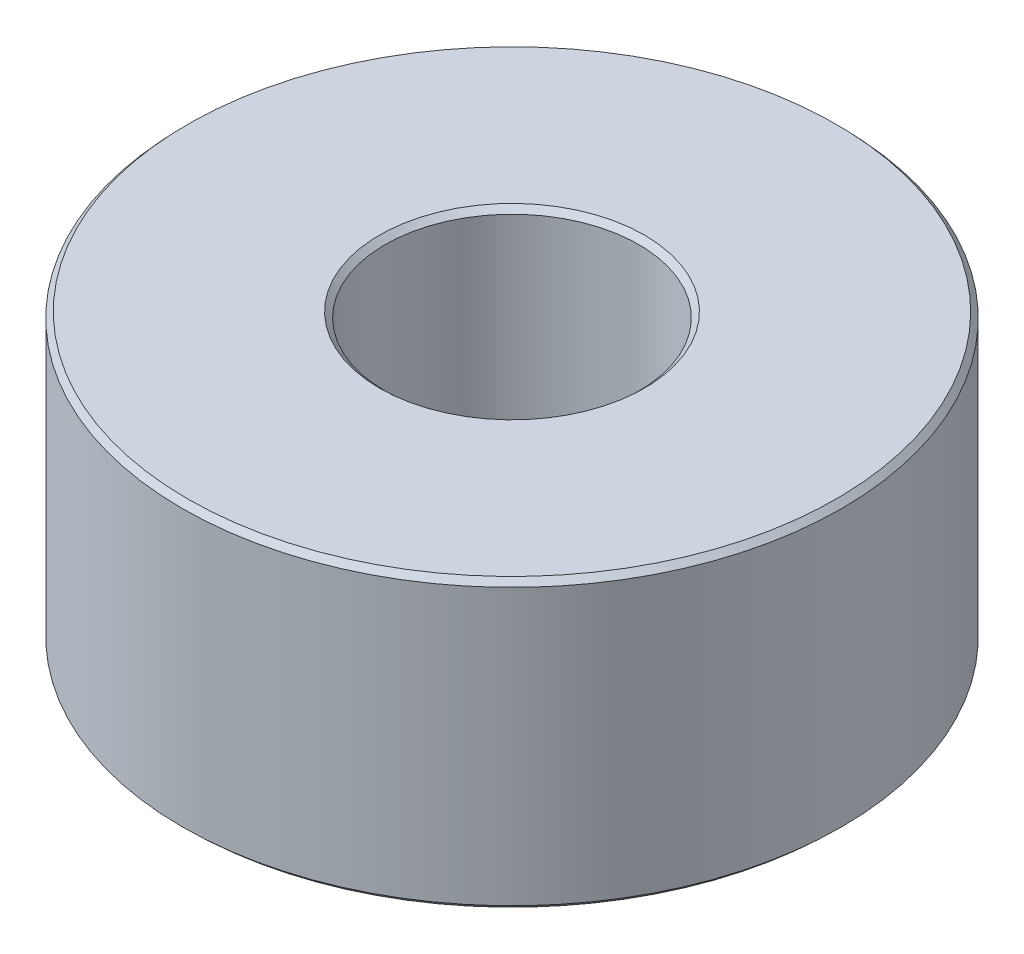
ISO-10303-21;
HEADER;
FILE_DESCRIPTION(('STEP AP214'),'2;1');
FILE_NAME('part.step','',(''),(''),'','','');
FILE_SCHEMA(('AUTOMOTIVE_DESIGN { 1 0 10303 214 1 1 1 1 }'));
ENDSEC;
DATA;
#1=APPLICATION_CONTEXT('core data for automotive mechanical design processes');
#2=APPLICATION_PROTOCOL_DEFINITION('international standard','automotive_design',2000,#1);
#3=PRODUCT_CONTEXT('',#1,'mechanical');
#4=PRODUCT('Part','Part','',(#3));
#5=PRODUCT_RELATED_PRODUCT_CATEGORY('part','',(#4));
#6=PRODUCT_DEFINITION_FORMATION('','',#4);
#7=PRODUCT_DEFINITION_CONTEXT('part definition',#1,'design');
#8=PRODUCT_DEFINITION('design','',#6,#7);
#9=PRODUCT_DEFINITION_SHAPE('','',#8);
#10=(LENGTH_UNIT() NAMED_UNIT(*) SI_UNIT(.MILLI.,.METRE.));
#11=(NAMED_UNIT(*) PLANE_ANGLE_UNIT() SI_UNIT($,.RADIAN.));
#12=(NAMED_UNIT(*) SI_UNIT($,.STERADIAN.) SOLID_ANGLE_UNIT());
#13=UNCERTAINTY_MEASURE_WITH_UNIT(LENGTH_MEASURE(1.E-05),#10,'distance_accuracy_value','');
#14=(GEOMETRIC_REPRESENTATION_CONTEXT(3) GLOBAL_UNCERTAINTY_ASSIGNED_CONTEXT((#13)) GLOBAL_UNIT_ASSIGNED_CONTEXT((#10,
#11,#12)) REPRESENTATION_CONTEXT('',''));
#15=CARTESIAN_POINT('',(0.,0.,0.));
#16=DIRECTION('',(0.,0.,1.));
#17=DIRECTION('',(1.,0.,0.));
#18=AXIS2_PLACEMENT_3D('',#15,#16,#17);
#19=CARTESIAN_POINT('',(0.,36.9616124464068,0.));
#20=DIRECTION('',(0.,-1.,0.));
#21=DIRECTION('',(0.,0.,-1.));
#22=AXIS2_PLACEMENT_3D('',#19,#20,#21);
#23=CYLINDRICAL_SURFACE('',#22,42.5);
#24=CARTESIAN_POINT('',(0.,0.688716306798586,0.));
#25=DIRECTION('',(0.,1.,0.));
#26=DIRECTION('',(0.,0.,1.));
#27=AXIS2_PLACEMENT_3D('',#24,#25,#26);
#28=CIRCLE('',#27,42.5);
#29=CARTESIAN_POINT('',(0.,0.688716306798585,42.5));
#30=VERTEX_POINT('',#29);
#31=EDGE_CURVE('E10',#30,#30,#28,.T.);
#32=ORIENTED_EDGE('',*,*,#31,.T.);
#33=EDGE_LOOP('',(#32));
#34=FACE_BOUND('',#33,.T.);
#35=CARTESIAN_POINT('',(0.,36.2285467041578,0.));
#36=DIRECTION('',(0.,1.,0.));
#37=DIRECTION('',(0.,0.,1.));
#38=AXIS2_PLACEMENT_3D('',#35,#36,#37);
#39=CIRCLE('',#38,42.5);
#40=CARTESIAN_POINT('',(0.,36.2285467041578,42.5));
#41=VERTEX_POINT('',#40);
#42=EDGE_CURVE('E50',#41,#41,#39,.F.);
#43=ORIENTED_EDGE('',*,*,#42,.T.);
#44=EDGE_LOOP('',(#43));
#45=FACE_BOUND('',#44,.T.);
#46=ADVANCED_FACE('F39',(#34,#45),#23,.T.);
#47=CARTESIAN_POINT('',(0.,36.9616124464068,0.));
#48=DIRECTION('',(0.,1.,0.));
#49=DIRECTION('',(0.,0.,1.));
#50=AXIS2_PLACEMENT_3D('',#47,#48,#49);
#51=PLANE('',#50);
#52=CARTESIAN_POINT('',(0.,36.9616124464068,0.));
#53=DIRECTION('',(0.,1.,0.));
#54=DIRECTION('',(0.,0.,1.));
#55=AXIS2_PLACEMENT_3D('',#52,#53,#54);
#56=CIRCLE('',#55,17.0864884740566);
#57=CARTESIAN_POINT('',(0.,36.9616124464068,17.0864884740566));
#58=VERTEX_POINT('',#57);
#59=EDGE_CURVE('E58',#58,#58,#56,.F.);
#60=ORIENTED_EDGE('',*,*,#59,.T.);
#61=EDGE_LOOP('',(#60));
#62=FACE_BOUND('',#61,.T.);
#63=CARTESIAN_POINT('',(0.,36.9616124464068,0.));
#64=DIRECTION('',(0.,1.,0.));
#65=DIRECTION('',(0.,0.,1.));
#66=AXIS2_PLACEMENT_3D('',#63,#64,#65);
#67=CIRCLE('',#66,41.8112836932014);
#68=CARTESIAN_POINT('',(0.,36.9616124464068,41.8112836932014));
#69=VERTEX_POINT('',#68);
#70=EDGE_CURVE('E61',#69,#69,#67,.T.);
#71=ORIENTED_EDGE('',*,*,#70,.T.);
#72=EDGE_LOOP('',(#71));
#73=FACE_BOUND('',#72,.T.);
#74=ADVANCED_FACE('F88',(#62,#73),#51,.T.);
#75=CARTESIAN_POINT('',(0.,0.,0.));
#76=DIRECTION('',(0.,1.,0.));
#77=DIRECTION('',(0.,0.,1.));
#78=AXIS2_PLACEMENT_3D('',#75,#76,#77);
#79=PLANE('',#78);
#80=CARTESIAN_POINT('',(0.,0.,0.));
#81=DIRECTION('',(0.,1.,0.));
#82=DIRECTION('',(0.,0.,1.));
#83=AXIS2_PLACEMENT_3D('',#80,#81,#82);
#84=CIRCLE('',#83,17.0421390386063);
#85=CARTESIAN_POINT('',(0.,0.,17.0421390386063));
#86=VERTEX_POINT('',#85);
#87=EDGE_CURVE('E51',#86,#86,#84,.T.);
#88=ORIENTED_EDGE('',*,*,#87,.T.);
#89=EDGE_LOOP('',(#88));
#90=FACE_BOUND('',#89,.T.);
#91=CARTESIAN_POINT('',(0.,0.,0.));
#92=DIRECTION('',(0.,1.,0.));
#93=DIRECTION('',(0.,0.,1.));
#94=AXIS2_PLACEMENT_3D('',#91,#92,#93);
#95=CIRCLE('',#94,41.7669342577511);
#96=CARTESIAN_POINT('',(0.,0.,41.7669342577511));
#97=VERTEX_POINT('',#96);
#98=EDGE_CURVE('E54',#97,#97,#95,.F.);
#99=ORIENTED_EDGE('',*,*,#98,.T.);
#100=EDGE_LOOP('',(#99));
#101=FACE_BOUND('',#100,.T.);
#102=ADVANCED_FACE('F83',(#90,#101),#79,.F.);
#103=CARTESIAN_POINT('',(0.,36.9616124464068,0.));
#104=DIRECTION('',(0.,-1.,0.));
#105=DIRECTION('',(0.,0.,-1.));
#106=AXIS2_PLACEMENT_3D('',#103,#104,#105);
#107=CYLINDRICAL_SURFACE('',#106,16.3534227318077);
#108=CARTESIAN_POINT('',(0.,36.2728961396082,0.));
#109=DIRECTION('',(0.,1.,0.));
#110=DIRECTION('',(0.,0.,1.));
#111=AXIS2_PLACEMENT_3D('',#108,#109,#110);
#112=CIRCLE('',#111,16.3534227318077);
#113=CARTESIAN_POINT('',(0.,36.2728961396082,16.3534227318077));
#114=VERTEX_POINT('',#113);
#115=EDGE_CURVE('E67',#114,#114,#112,.T.);
#116=ORIENTED_EDGE('',*,*,#115,.T.);
#117=EDGE_LOOP('',(#116));
#118=FACE_BOUND('',#117,.T.);
#119=CARTESIAN_POINT('',(0.,0.733065742248969,0.));
#120=DIRECTION('',(0.,1.,0.));
#121=DIRECTION('',(0.,0.,1.));
#122=AXIS2_PLACEMENT_3D('',#119,#120,#121);
#123=CIRCLE('',#122,16.3534227318077);
#124=CARTESIAN_POINT('',(0.,0.733065742248969,16.3534227318077));
#125=VERTEX_POINT('',#124);
#126=EDGE_CURVE('E69',#125,#125,#123,.F.);
#127=ORIENTED_EDGE('',*,*,#126,.T.);
#128=EDGE_LOOP('',(#127));
#129=FACE_BOUND('',#128,.T.);
#130=ADVANCED_FACE('F71',(#118,#129),#107,.F.);
#131=CARTESIAN_POINT('',(0.,36.2728961396082,0.));
#132=DIRECTION('',(0.,1.,0.));
#133=DIRECTION('',(0.,0.,1.));
#134=AXIS2_PLACEMENT_3D('',#131,#132,#133);
#135=CONICAL_SURFACE('',#134,16.3534227318077,0.816580903368573);
#136=CARTESIAN_POINT('',(0.,36.9616124464068,17.0864884740566));
#137=CARTESIAN_POINT('',(0.,36.954438318211,17.0788523725748));
#138=CARTESIAN_POINT('',(0.,36.9472641900152,17.0712162710931));
#139=CARTESIAN_POINT('',(0.,36.9329159336235,17.0559440681295));
#140=CARTESIAN_POINT('',(0.,36.9257418054277,17.0483079666478));
#141=CARTESIAN_POINT('',(0.,36.9113935490361,17.0330357636843));
#142=CARTESIAN_POINT('',(0.,36.9042194208403,17.0253996622025));
#143=CARTESIAN_POINT('',(0.,36.8898711644486,17.010127459239));
#144=CARTESIAN_POINT('',(0.,36.8826970362528,17.0024913577572));
#145=CARTESIAN_POINT('',(0.,36.8683487798612,16.9872191547937));
#146=CARTESIAN_POINT('',(0.,36.8611746516653,16.9795830533119));
#147=CARTESIAN_POINT('',(0.,36.8468263952737,16.9643108503484));
#148=CARTESIAN_POINT('',(0.,36.8396522670779,16.9566747488667));
#149=CARTESIAN_POINT('',(0.,36.8253040106862,16.9414025459031));
#150=CARTESIAN_POINT('',(0.,36.8181298824904,16.9337664444214));
#151=CARTESIAN_POINT('',(0.,36.8037816260988,16.9184942414579));
#152=CARTESIAN_POINT('',(0.,36.796607497903,16.9108581399761));
#153=CARTESIAN_POINT('',(0.,36.7822592415113,16.8955859370126));
#154=CARTESIAN_POINT('',(0.,36.7750851133155,16.8879498355308));
#155=CARTESIAN_POINT('',(0.,36.7607368569239,16.8726776325673));
#156=CARTESIAN_POINT('',(0.,36.7535627287281,16.8650415310855));
#157=CARTESIAN_POINT('',(0.,36.7392144723364,16.849769328122));
#158=CARTESIAN_POINT('',(0.,36.7320403441406,16.8421332266403));
#159=CARTESIAN_POINT('',(0.,36.717692087749,16.8268610236768));
#160=CARTESIAN_POINT('',(0.,36.7105179595532,16.819224922195));
#161=CARTESIAN_POINT('',(0.,36.6961697031615,16.8039527192315));
#162=CARTESIAN_POINT('',(0.,36.6889955749657,16.7963166177497));
#163=CARTESIAN_POINT('',(0.,36.6746473185741,16.7810444147862));
#164=CARTESIAN_POINT('',(0.,36.6674731903782,16.7734083133044));
#165=CARTESIAN_POINT('',(0.,36.6531249339866,16.7581361103409));
#166=CARTESIAN_POINT('',(0.,36.6459508057908,16.7505000088592));
#167=CARTESIAN_POINT('',(0.,36.6316025493991,16.7352278058956));
#168=CARTESIAN_POINT('',(0.,36.6244284212033,16.7275917044139));
#169=CARTESIAN_POINT('',(0.,36.6100801648117,16.7123195014504));
#170=CARTESIAN_POINT('',(0.,36.6029060366159,16.7046833999686));
#171=CARTESIAN_POINT('',(0.,36.5885577802242,16.6894111970051));
#172=CARTESIAN_POINT('',(0.,36.5813836520284,16.6817750955233));
#173=CARTESIAN_POINT('',(0.,36.5670353956368,16.6665028925598));
#174=CARTESIAN_POINT('',(0.,36.559861267441,16.658866791078));
#175=CARTESIAN_POINT('',(0.,36.5455130110493,16.6435945881145));
#176=CARTESIAN_POINT('',(0.,36.5383388828535,16.6359584866328));
#177=CARTESIAN_POINT('',(0.,36.5239906264619,16.6206862836692));
#178=CARTESIAN_POINT('',(0.,36.5168164982661,16.6130501821875));
#179=CARTESIAN_POINT('',(0.,36.5024682418744,16.597777979224));
#180=CARTESIAN_POINT('',(0.,36.4952941136786,16.5901418777422));
#181=CARTESIAN_POINT('',(0.,36.480945857287,16.5748696747787));
#182=CARTESIAN_POINT('',(0.,36.4737717290911,16.5672335732969));
#183=CARTESIAN_POINT('',(0.,36.4594234726995,16.5519613703334));
#184=CARTESIAN_POINT('',(0.,36.4522493445037,16.5443252688516));
#185=CARTESIAN_POINT('',(0.,36.4379010881121,16.5290530658881));
#186=CARTESIAN_POINT('',(0.,36.4307269599162,16.5214169644064));
#187=CARTESIAN_POINT('',(0.,36.4163787035246,16.5061447614429));
#188=CARTESIAN_POINT('',(0.,36.4092045753288,16.4985086599611));
#189=CARTESIAN_POINT('',(0.,36.3948563189371,16.4832364569976));
#190=CARTESIAN_POINT('',(0.,36.3876821907413,16.4756003555158));
#191=CARTESIAN_POINT('',(0.,36.3733339343497,16.4603281525523));
#192=CARTESIAN_POINT('',(0.,36.3661598061539,16.4526920510705));
#193=CARTESIAN_POINT('',(0.,36.3518115497622,16.437419848107));
#194=CARTESIAN_POINT('',(0.,36.3446374215664,16.4297837466253));
#195=CARTESIAN_POINT('',(0.,36.3302891651748,16.4145115436617));
#196=CARTESIAN_POINT('',(0.,36.323115036979,16.40687544218));
#197=CARTESIAN_POINT('',(0.,36.3087667805873,16.3916032392165));
#198=CARTESIAN_POINT('',(0.,36.3015926523915,16.3839671377347));
#199=CARTESIAN_POINT('',(0.,36.2872443959999,16.3686949347712));
#200=CARTESIAN_POINT('',(0.,36.2800702678041,16.3610588332894));
#201=CARTESIAN_POINT('',(0.,36.2728961396082,16.3534227318077));
#202=B_SPLINE_CURVE_WITH_KNOTS('',3,(#136,#137,#138,#139,#140,#141,#142,#143,#144,#145,#146,
#147,#148,#149,#150,#151,#152,#153,#154,#155,#156,#157,#158,#159,#160,#161,#162,#163,#164,#165,
#166,#167,#168,#169,#170,#171,#172,#173,#174,#175,#176,#177,#178,#179,#180,#181,#182,#183,#184,
#185,#186,#187,#188,#189,#190,#191,#192,#193,#194,#195,#196,#197,#198,#199,#200,#201),
.UNSPECIFIED.,.F.,.F.,(4,2,2,2,2,2,2,2,2,2,2,2,2,2,2,2,2,2,2,2,2,2,2,2,2,2,2,2,2,2,2,2,4),(0.,
0.0314325221846413,0.06286504436928,0.0942975665539212,0.125730088738562,0.157162610923201,
0.188595133107842,0.220027655292484,0.251460177477122,0.282892699661764,0.314325221846405,
0.345757744031044,0.377190266215685,0.408622788400326,0.440055310584965,0.471487832769606,
0.502920354954247,0.534352877138886,0.565785399323527,0.597217921508169,0.628650443692807,
0.660082965877449,0.691515488062087,0.722948010246729,0.75438053243137,0.785813054616009,
0.81724557680065,0.848678098985291,0.88011062116993,0.911543143354571,0.942975665539213,
0.974408187723851,1.00584070990849),.UNSPECIFIED.);
#203=EDGE_CURVE('BSEAM77',#58,#114,#202,.T.);
#204=ORIENTED_EDGE('',*,*,#59,.F.);
#205=ORIENTED_EDGE('',*,*,#115,.F.);
#206=ORIENTED_EDGE('',*,*,#203,.T.);
#207=ORIENTED_EDGE('',*,*,#203,.F.);
#208=EDGE_LOOP('',(#204,#206,#205,#207));
#209=FACE_BOUND('',#208,.T.);
#210=ADVANCED_FACE('F77',(#209),#135,.F.);
#211=CARTESIAN_POINT('',(0.,0.,0.));
#212=DIRECTION('',(0.,-1.,0.));
#213=DIRECTION('',(0.,0.,-1.));
#214=AXIS2_PLACEMENT_3D('',#211,#212,#213);
#215=CONICAL_SURFACE('',#214,17.0421390386063,0.754215423426325);
#216=ORIENTED_EDGE('',*,*,#126,.F.);
#217=EDGE_LOOP('',(#216));
#218=FACE_BOUND('',#217,.T.);
#219=ORIENTED_EDGE('',*,*,#87,.F.);
#220=EDGE_LOOP('',(#219));
#221=FACE_BOUND('',#220,.T.);
#222=ADVANCED_FACE('F73',(#218,#221),#215,.F.);
#223=CARTESIAN_POINT('',(0.,0.688716306798586,0.));
#224=DIRECTION('',(0.,1.,0.));
#225=DIRECTION('',(0.,0.,1.));
#226=AXIS2_PLACEMENT_3D('',#223,#224,#225);
#227=CONICAL_SURFACE('',#226,42.5,0.816580903368575);
#228=CARTESIAN_POINT('',(0.,0.,41.7669342577511));
#229=CARTESIAN_POINT('',(0.,0.00717412819582039,41.7745703592328));
#230=CARTESIAN_POINT('',(0.,0.0143482563916383,41.7822064607146));
#231=CARTESIAN_POINT('',(0.,0.0286965127832742,41.7974786636781));
#232=CARTESIAN_POINT('',(0.,0.0358706409790921,41.8051147651599));
#233=CARTESIAN_POINT('',(0.,0.0502188973707297,41.8203869681234));
#234=CARTESIAN_POINT('',(0.,0.0573930255665493,41.8280230696051));
#235=CARTESIAN_POINT('',(0.,0.0717412819581864,41.8432952725687));
#236=CARTESIAN_POINT('',(0.,0.0789154101540039,41.8509313740504));
#237=CARTESIAN_POINT('',(0.,0.0932636665456411,41.8662035770139));
#238=CARTESIAN_POINT('',(0.,0.100437794741461,41.8738396784957));
#239=CARTESIAN_POINT('',(0.,0.114786051133098,41.8891118814592));
#240=CARTESIAN_POINT('',(0.,0.121960179328916,41.896747982941));
#241=CARTESIAN_POINT('',(0.,0.136308435720552,41.9120201859045));
#242=CARTESIAN_POINT('',(0.,0.143482563916371,41.9196562873863));
#243=CARTESIAN_POINT('',(0.,0.157830820308009,41.9349284903498));
#244=CARTESIAN_POINT('',(0.,0.165004948503828,41.9425645918315));
#245=CARTESIAN_POINT('',(0.,0.179353204895465,41.9578367947951));
#246=CARTESIAN_POINT('',(0.,0.186527333091283,41.9654728962768));
#247=CARTESIAN_POINT('',(0.,0.20087558948292,41.9807450992403));
#248=CARTESIAN_POINT('',(0.,0.20804971767874,41.9883812007221));
#249=CARTESIAN_POINT('',(0.,0.222397974070377,42.0036534036856));
#250=CARTESIAN_POINT('',(0.,0.229572102266194,42.0112895051674));
#251=CARTESIAN_POINT('',(0.,0.243920358657832,42.0265617081309));
#252=CARTESIAN_POINT('',(0.,0.251094486853651,42.0341978096127));
#253=CARTESIAN_POINT('',(0.,0.265442743245289,42.0494700125762));
#254=CARTESIAN_POINT('',(0.,0.272616871441106,42.0571061140579));
#255=CARTESIAN_POINT('',(0.,0.286965127832743,42.0723783170215));
#256=CARTESIAN_POINT('',(0.,0.294139256028563,42.0800144185032));
#257=CARTESIAN_POINT('',(0.,0.3084875124202,42.0952866214667));
#258=CARTESIAN_POINT('',(0.,0.315661640616018,42.1029227229485));
#259=CARTESIAN_POINT('',(0.,0.330009897007655,42.118194925912));
#260=CARTESIAN_POINT('',(0.,0.337184025203474,42.1258310273938));
#261=CARTESIAN_POINT('',(0.,0.351532281595112,42.1411032303573));
#262=CARTESIAN_POINT('',(0.,0.358706409790931,42.1487393318391));
#263=CARTESIAN_POINT('',(0.,0.373054666182567,42.1640115348026));
#264=CARTESIAN_POINT('',(0.,0.380228794378385,42.1716476362843));
#265=CARTESIAN_POINT('',(0.,0.394577050770022,42.1869198392479));
#266=CARTESIAN_POINT('',(0.,0.401751178965842,42.1945559407296));
#267=CARTESIAN_POINT('',(0.,0.416099435357479,42.2098281436931));
#268=CARTESIAN_POINT('',(0.,0.423273563553297,42.2174642451749));
#269=CARTESIAN_POINT('',(0.,0.437621819944934,42.2327364481384));
#270=CARTESIAN_POINT('',(0.,0.444795948140754,42.2403725496202));
#271=CARTESIAN_POINT('',(0.,0.459144204532391,42.2556447525837));
#272=CARTESIAN_POINT('',(0.,0.466318332728208,42.2632808540655));
#273=CARTESIAN_POINT('',(0.,0.480666589119845,42.278553057029));
#274=CARTESIAN_POINT('',(0.,0.487840717315664,42.2861891585107));
#275=CARTESIAN_POINT('',(0.,0.502188973707302,42.3014613614743));
#276=CARTESIAN_POINT('',(0.,0.509363101903121,42.309097462956));
#277=CARTESIAN_POINT('',(0.,0.523711358294758,42.3243696659195));
#278=CARTESIAN_POINT('',(0.,0.530885486490576,42.3320057674013));
#279=CARTESIAN_POINT('',(0.,0.545233742882213,42.3472779703648));
#280=CARTESIAN_POINT('',(0.,0.552407871078033,42.3549140718466));
#281=CARTESIAN_POINT('',(0.,0.56675612746967,42.3701862748101));
#282=CARTESIAN_POINT('',(0.,0.573930255665487,42.3778223762919));
#283=CARTESIAN_POINT('',(0.,0.588278512057124,42.3930945792554));
#284=CARTESIAN_POINT('',(0.,0.595452640252944,42.4007306807371));
#285=CARTESIAN_POINT('',(0.,0.609800896644581,42.4160028837006));
#286=CARTESIAN_POINT('',(0.,0.616975024840399,42.4236389851824));
#287=CARTESIAN_POINT('',(0.,0.631323281232036,42.4389111881459));
#288=CARTESIAN_POINT('',(0.,0.638497409427856,42.4465472896277));
#289=CARTESIAN_POINT('',(0.,0.652845665819493,42.4618194925912));
#290=CARTESIAN_POINT('',(0.,0.660019794015311,42.469455594073));
#291=CARTESIAN_POINT('',(0.,0.674368050406947,42.4847277970365));
#292=CARTESIAN_POINT('',(0.,0.681542178602765,42.4923638985182));
#293=CARTESIAN_POINT('',(0.,0.688716306798585,42.5));
#294=B_SPLINE_CURVE_WITH_KNOTS('',3,(#228,#229,#230,#231,#232,#233,#234,#235,#236,#237,#238,
#239,#240,#241,#242,#243,#244,#245,#246,#247,#248,#249,#250,#251,#252,#253,#254,#255,#256,#257,
#258,#259,#260,#261,#262,#263,#264,#265,#266,#267,#268,#269,#270,#271,#272,#273,#274,#275,#276,
#277,#278,#279,#280,#281,#282,#283,#284,#285,#286,#287,#288,#289,#290,#291,#292,#293),
.UNSPECIFIED.,.F.,.F.,(4,2,2,2,2,2,2,2,2,2,2,2,2,2,2,2,2,2,2,2,2,2,2,2,2,2,2,2,2,2,2,2,4),(0.,
0.0314325221846392,0.0628650443692834,0.0942975665539226,0.125730088738567,0.157162610923206,
0.18859513310785,0.220027655292489,0.251460177477129,0.282892699661773,0.314325221846412,
0.345757744031056,0.377190266215695,0.40862278840034,0.440055310584979,0.471487832769623,
0.502920354954262,0.534352877138901,0.565785399323546,0.597217921508185,0.628650443692829,
0.660082965877468,0.691515488062112,0.722948010246751,0.754380532431391,0.785813054616035,
0.817245576800674,0.848678098985318,0.880110621169957,0.911543143354602,0.942975665539241,
0.974408187723885,1.00584070990852),.UNSPECIFIED.);
#295=EDGE_CURVE('BSEAM76',#97,#30,#294,.T.);
#296=ORIENTED_EDGE('',*,*,#98,.F.);
#297=ORIENTED_EDGE('',*,*,#31,.F.);
#298=ORIENTED_EDGE('',*,*,#295,.T.);
#299=ORIENTED_EDGE('',*,*,#295,.F.);
#300=EDGE_LOOP('',(#296,#298,#297,#299));
#301=FACE_BOUND('',#300,.T.);
#302=ADVANCED_FACE('F76',(#301),#227,.T.);
#303=CARTESIAN_POINT('',(0.,36.9616124464068,0.));
#304=DIRECTION('',(0.,-1.,0.));
#305=DIRECTION('',(0.,0.,-1.));
#306=AXIS2_PLACEMENT_3D('',#303,#304,#305);
#307=CONICAL_SURFACE('',#306,41.8112836932014,0.754215423426328);
#308=ORIENTED_EDGE('',*,*,#42,.F.);
#309=EDGE_LOOP('',(#308));
#310=FACE_BOUND('',#309,.T.);
#311=ORIENTED_EDGE('',*,*,#70,.F.);
#312=EDGE_LOOP('',(#311));
#313=FACE_BOUND('',#312,.T.);
#314=ADVANCED_FACE('F45',(#310,#313),#307,.T.);
#315=CLOSED_SHELL('',(#46,#74,#102,#130,#210,#222,#302,#314));
#316=MANIFOLD_SOLID_BREP('B2',#315);
#317=ADVANCED_BREP_SHAPE_REPRESENTATION('',(#18,#316),#14);
#318=SHAPE_DEFINITION_REPRESENTATION(#9,#317);
ENDSEC;
END-ISO-10303-21;
